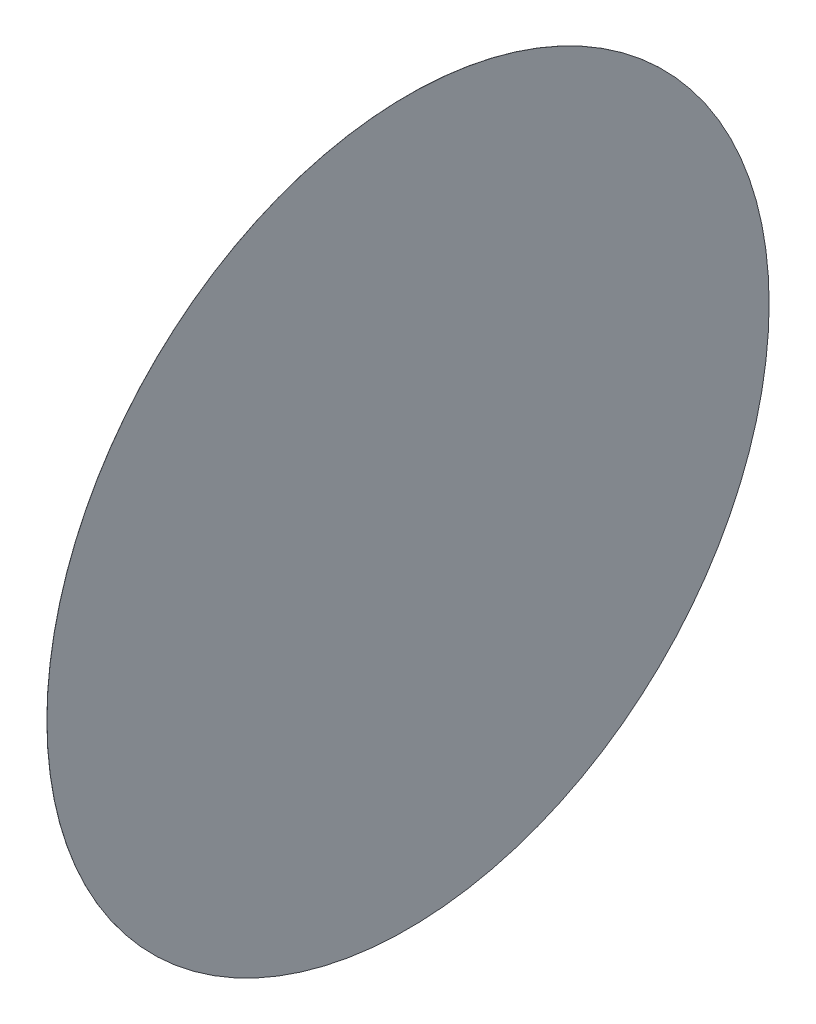
ISO-10303-21;
HEADER;
FILE_DESCRIPTION(('STEP AP214'),'2;1');
FILE_NAME('part.step','',(''),(''),'','','');
FILE_SCHEMA(('AUTOMOTIVE_DESIGN { 1 0 10303 214 1 1 1 1 }'));
ENDSEC;
DATA;
#1=APPLICATION_CONTEXT('core data for automotive mechanical design processes');
#2=APPLICATION_PROTOCOL_DEFINITION('international standard','automotive_design',2000,#1);
#3=PRODUCT_CONTEXT('',#1,'mechanical');
#4=PRODUCT('Part','Part','',(#3));
#5=PRODUCT_RELATED_PRODUCT_CATEGORY('part','',(#4));
#6=PRODUCT_DEFINITION_FORMATION('','',#4);
#7=PRODUCT_DEFINITION_CONTEXT('part definition',#1,'design');
#8=PRODUCT_DEFINITION('design','',#6,#7);
#9=PRODUCT_DEFINITION_SHAPE('','',#8);
#10=(LENGTH_UNIT() NAMED_UNIT(*) SI_UNIT(.MILLI.,.METRE.));
#11=(NAMED_UNIT(*) PLANE_ANGLE_UNIT() SI_UNIT($,.RADIAN.));
#12=(NAMED_UNIT(*) SI_UNIT($,.STERADIAN.) SOLID_ANGLE_UNIT());
#13=UNCERTAINTY_MEASURE_WITH_UNIT(LENGTH_MEASURE(1.E-05),#10,'distance_accuracy_value','');
#14=(GEOMETRIC_REPRESENTATION_CONTEXT(3) GLOBAL_UNCERTAINTY_ASSIGNED_CONTEXT((#13)) GLOBAL_UNIT_ASSIGNED_CONTEXT((#10,
#11,#12)) REPRESENTATION_CONTEXT('',''));
#15=CARTESIAN_POINT('',(0.,0.,0.));
#16=DIRECTION('',(0.,0.,1.));
#17=DIRECTION('',(1.,0.,0.));
#18=AXIS2_PLACEMENT_3D('',#15,#16,#17);
#19=CARTESIAN_POINT('',(0.001,0.,0.));
#20=DIRECTION('',(-1.,0.,0.));
#21=DIRECTION('',(0.,0.,1.));
#22=AXIS2_PLACEMENT_3D('',#19,#20,#21);
#23=CYLINDRICAL_SURFACE('',#22,4.);
#24=CARTESIAN_POINT('',(0.001,0.,0.));
#25=DIRECTION('',(1.,0.,0.));
#26=DIRECTION('',(0.,0.,-1.));
#27=AXIS2_PLACEMENT_3D('',#24,#25,#26);
#28=CIRCLE('',#27,4.);
#29=CARTESIAN_POINT('',(0.001,0.,-4.));
#30=VERTEX_POINT('',#29);
#31=EDGE_CURVE('E10',#30,#30,#28,.T.);
#32=ORIENTED_EDGE('',*,*,#31,.F.);
#33=EDGE_LOOP('',(#32));
#34=FACE_BOUND('',#33,.T.);
#35=CARTESIAN_POINT('',(0.,0.,0.));
#36=DIRECTION('',(1.,0.,0.));
#37=DIRECTION('',(0.,0.,-1.));
#38=AXIS2_PLACEMENT_3D('',#35,#36,#37);
#39=CIRCLE('',#38,4.);
#40=CARTESIAN_POINT('',(0.,0.,-4.));
#41=VERTEX_POINT('',#40);
#42=EDGE_CURVE('E40',#41,#41,#39,.T.);
#43=ORIENTED_EDGE('',*,*,#42,.T.);
#44=EDGE_LOOP('',(#43));
#45=FACE_BOUND('',#44,.T.);
#46=ADVANCED_FACE('F37',(#34,#45),#23,.T.);
#47=CARTESIAN_POINT('',(0.001,0.,0.));
#48=DIRECTION('',(1.,0.,0.));
#49=DIRECTION('',(0.,0.,-1.));
#50=AXIS2_PLACEMENT_3D('',#47,#48,#49);
#51=PLANE('',#50);
#52=ORIENTED_EDGE('',*,*,#31,.T.);
#53=EDGE_LOOP('',(#52));
#54=FACE_BOUND('',#53,.T.);
#55=ADVANCED_FACE('F54',(#54),#51,.T.);
#56=CARTESIAN_POINT('',(0.,0.,0.));
#57=DIRECTION('',(1.,0.,0.));
#58=DIRECTION('',(0.,0.,-1.));
#59=AXIS2_PLACEMENT_3D('',#56,#57,#58);
#60=PLANE('',#59);
#61=ORIENTED_EDGE('',*,*,#42,.F.);
#62=EDGE_LOOP('',(#61));
#63=FACE_BOUND('',#62,.T.);
#64=ADVANCED_FACE('F52',(#63),#60,.F.);
#65=CLOSED_SHELL('',(#46,#55,#64));
#66=MANIFOLD_SOLID_BREP('B2',#65);
#67=ADVANCED_BREP_SHAPE_REPRESENTATION('',(#18,#66),#14);
#68=SHAPE_DEFINITION_REPRESENTATION(#9,#67);
ENDSEC;
END-ISO-10303-21;
